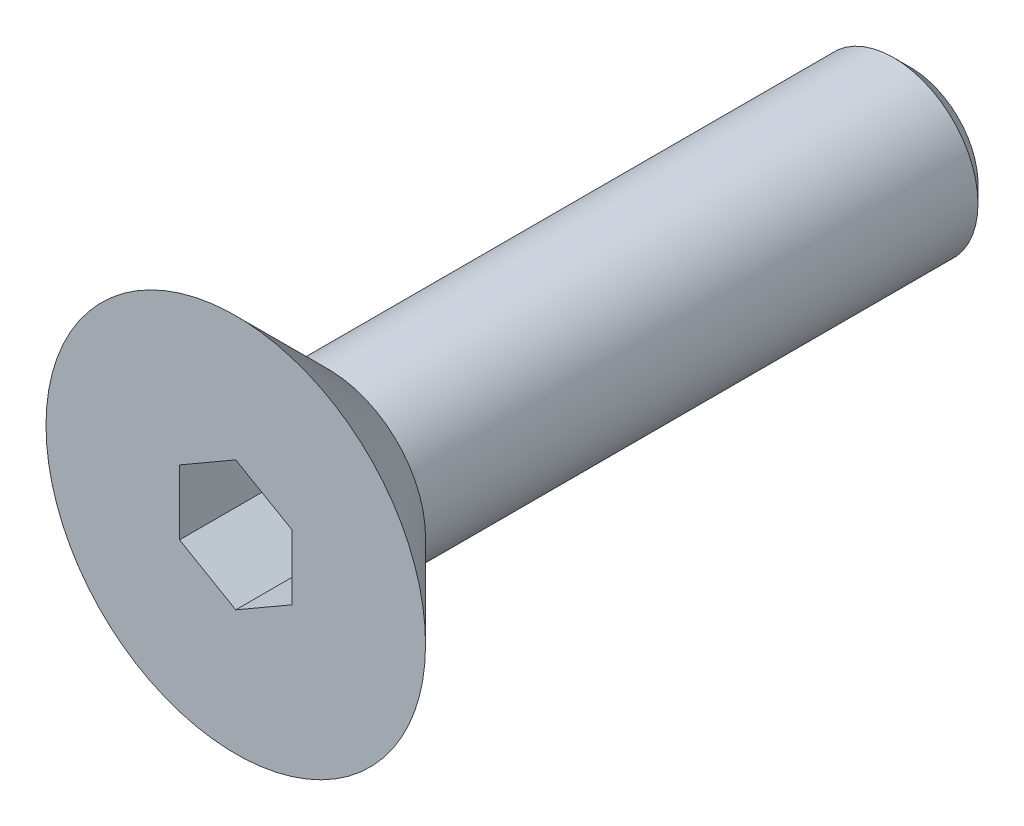
ISO-10303-21;
HEADER;
FILE_DESCRIPTION(('STEP AP214'),'2;1');
FILE_NAME('part.step','',(''),(''),'','','');
FILE_SCHEMA(('AUTOMOTIVE_DESIGN { 1 0 10303 214 1 1 1 1 }'));
ENDSEC;
DATA;
#1=APPLICATION_CONTEXT('core data for automotive mechanical design processes');
#2=APPLICATION_PROTOCOL_DEFINITION('international standard','automotive_design',2000,#1);
#3=PRODUCT_CONTEXT('',#1,'mechanical');
#4=PRODUCT('Part','Part','',(#3));
#5=PRODUCT_RELATED_PRODUCT_CATEGORY('part','',(#4));
#6=PRODUCT_DEFINITION_FORMATION('','',#4);
#7=PRODUCT_DEFINITION_CONTEXT('part definition',#1,'design');
#8=PRODUCT_DEFINITION('design','',#6,#7);
#9=PRODUCT_DEFINITION_SHAPE('','',#8);
#10=(LENGTH_UNIT() NAMED_UNIT(*) SI_UNIT(.MILLI.,.METRE.));
#11=(NAMED_UNIT(*) PLANE_ANGLE_UNIT() SI_UNIT($,.RADIAN.));
#12=(NAMED_UNIT(*) SI_UNIT($,.STERADIAN.) SOLID_ANGLE_UNIT());
#13=UNCERTAINTY_MEASURE_WITH_UNIT(LENGTH_MEASURE(1.E-05),#10,'distance_accuracy_value','');
#14=(GEOMETRIC_REPRESENTATION_CONTEXT(3) GLOBAL_UNCERTAINTY_ASSIGNED_CONTEXT((#13)) GLOBAL_UNIT_ASSIGNED_CONTEXT((#10,
#11,#12)) REPRESENTATION_CONTEXT('',''));
#15=CARTESIAN_POINT('',(0.,0.,0.));
#16=DIRECTION('',(0.,0.,1.));
#17=DIRECTION('',(1.,0.,0.));
#18=AXIS2_PLACEMENT_3D('',#15,#16,#17);
#19=CARTESIAN_POINT('',(0.,0.,0.));
#20=DIRECTION('',(0.,0.,1.));
#21=DIRECTION('',(1.,0.,0.));
#22=AXIS2_PLACEMENT_3D('',#19,#20,#21);
#23=PLANE('',#22);
#24=CARTESIAN_POINT('',(0.,0.,0.));
#25=DIRECTION('',(0.,0.,1.));
#26=DIRECTION('',(1.,0.,0.));
#27=AXIS2_PLACEMENT_3D('',#24,#25,#26);
#28=CIRCLE('',#27,1.72499999999999);
#29=CARTESIAN_POINT('',(1.72499999999999,0.,0.));
#30=VERTEX_POINT('',#29);
#31=EDGE_CURVE('E11',#30,#30,#28,.F.);
#32=ORIENTED_EDGE('',*,*,#31,.T.);
#33=EDGE_LOOP('',(#32));
#34=FACE_BOUND('',#33,.T.);
#35=CARTESIAN_POINT('',(0.,0.,0.));
#36=DIRECTION('',(0.,0.,1.));
#37=DIRECTION('',(1.,0.,0.));
#38=AXIS2_PLACEMENT_3D('',#35,#36,#37);
#39=CIRCLE('',#38,1.5);
#40=CARTESIAN_POINT('',(1.5,0.,0.));
#41=VERTEX_POINT('',#40);
#42=EDGE_CURVE('E144',#41,#41,#39,.F.);
#43=ORIENTED_EDGE('',*,*,#42,.F.);
#44=EDGE_LOOP('',(#43));
#45=FACE_BOUND('',#44,.T.);
#46=ADVANCED_FACE('F34',(#34,#45),#23,.F.);
#47=CARTESIAN_POINT('',(0.,0.,1.65));
#48=DIRECTION('',(0.,0.,1.));
#49=DIRECTION('',(1.,0.,0.));
#50=AXIS2_PLACEMENT_3D('',#47,#48,#49);
#51=PLANE('',#50);
#52=DIRECTION('',(-0.866025403784439,0.5,0.));
#53=VECTOR('',#52,1.);
#54=CARTESIAN_POINT('',(1.,0.577350269189626,1.65));
#55=LINE('',#54,#53);
#56=CARTESIAN_POINT('',(1.,0.577350269189626,1.65));
#57=VERTEX_POINT('',#56);
#58=CARTESIAN_POINT('',(0.,1.15470053837925,1.65));
#59=VERTEX_POINT('',#58);
#60=EDGE_CURVE('E49',#57,#59,#55,.T.);
#61=ORIENTED_EDGE('',*,*,#60,.F.);
#62=DIRECTION('',(0.,1.,0.));
#63=VECTOR('',#62,1.);
#64=CARTESIAN_POINT('',(1.,-0.577350269189626,1.65));
#65=LINE('',#64,#63);
#66=CARTESIAN_POINT('',(1.,-0.577350269189626,1.65));
#67=VERTEX_POINT('',#66);
#68=EDGE_CURVE('E132',#67,#57,#65,.T.);
#69=ORIENTED_EDGE('',*,*,#68,.F.);
#70=DIRECTION('',(0.866025403784439,0.5,0.));
#71=VECTOR('',#70,1.);
#72=CARTESIAN_POINT('',(0.,-1.15470053837925,1.65));
#73=LINE('',#72,#71);
#74=CARTESIAN_POINT('',(0.,-1.15470053837925,1.65));
#75=VERTEX_POINT('',#74);
#76=EDGE_CURVE('E130',#75,#67,#73,.T.);
#77=ORIENTED_EDGE('',*,*,#76,.F.);
#78=DIRECTION('',(0.866025403784439,-0.5,0.));
#79=VECTOR('',#78,1.);
#80=CARTESIAN_POINT('',(-1.,-0.577350269189626,1.65));
#81=LINE('',#80,#79);
#82=CARTESIAN_POINT('',(-1.,-0.577350269189626,1.65));
#83=VERTEX_POINT('',#82);
#84=EDGE_CURVE('E97',#83,#75,#81,.T.);
#85=ORIENTED_EDGE('',*,*,#84,.F.);
#86=DIRECTION('',(0.,-1.,0.));
#87=VECTOR('',#86,1.);
#88=CARTESIAN_POINT('',(-1.,0.577350269189626,1.65));
#89=LINE('',#88,#87);
#90=CARTESIAN_POINT('',(-1.,0.577350269189626,1.65));
#91=VERTEX_POINT('',#90);
#92=EDGE_CURVE('E126',#91,#83,#89,.T.);
#93=ORIENTED_EDGE('',*,*,#92,.F.);
#94=DIRECTION('',(-0.866025403784439,-0.5,0.));
#95=VECTOR('',#94,1.);
#96=CARTESIAN_POINT('',(0.,1.15470053837925,1.65));
#97=LINE('',#96,#95);
#98=EDGE_CURVE('E123',#59,#91,#97,.T.);
#99=ORIENTED_EDGE('',*,*,#98,.F.);
#100=EDGE_LOOP('',(#61,#69,#77,#85,#93,#99));
#101=FACE_BOUND('',#100,.T.);
#102=CARTESIAN_POINT('',(0.,0.,1.65));
#103=DIRECTION('',(0.,0.,1.));
#104=DIRECTION('',(1.,0.,0.));
#105=AXIS2_PLACEMENT_3D('',#102,#103,#104);
#106=CIRCLE('',#105,3.375);
#107=CARTESIAN_POINT('',(3.375,0.,1.65));
#108=VERTEX_POINT('',#107);
#109=EDGE_CURVE('E136',#108,#108,#106,.T.);
#110=ORIENTED_EDGE('',*,*,#109,.T.);
#111=EDGE_LOOP('',(#110));
#112=FACE_BOUND('',#111,.T.);
#113=ADVANCED_FACE('F167',(#101,#112),#51,.T.);
#114=CARTESIAN_POINT('',(0.,0.,-10.35));
#115=DIRECTION('',(0.,0.,1.));
#116=DIRECTION('',(1.,0.,0.));
#117=AXIS2_PLACEMENT_3D('',#114,#115,#116);
#118=CYLINDRICAL_SURFACE('',#117,1.5);
#119=CARTESIAN_POINT('',(0.,0.,-10.05));
#120=DIRECTION('',(0.,0.,-1.));
#121=DIRECTION('',(-1.,0.,0.));
#122=AXIS2_PLACEMENT_3D('',#119,#120,#121);
#123=CIRCLE('',#122,1.5);
#124=CARTESIAN_POINT('',(-1.5,0.,-10.05));
#125=VERTEX_POINT('',#124);
#126=EDGE_CURVE('E42',#125,#125,#123,.F.);
#127=ORIENTED_EDGE('',*,*,#126,.T.);
#128=EDGE_LOOP('',(#127));
#129=FACE_BOUND('',#128,.T.);
#130=ORIENTED_EDGE('',*,*,#42,.T.);
#131=EDGE_LOOP('',(#130));
#132=FACE_BOUND('',#131,.T.);
#133=ADVANCED_FACE('F152',(#129,#132),#118,.T.);
#134=CARTESIAN_POINT('',(0.,0.,-10.35));
#135=DIRECTION('',(0.,0.,-1.));
#136=DIRECTION('',(-1.,0.,0.));
#137=AXIS2_PLACEMENT_3D('',#134,#135,#136);
#138=PLANE('',#137);
#139=CARTESIAN_POINT('',(0.,0.,-10.35));
#140=DIRECTION('',(0.,0.,-1.));
#141=DIRECTION('',(-1.,0.,0.));
#142=AXIS2_PLACEMENT_3D('',#139,#140,#141);
#143=CIRCLE('',#142,1.2);
#144=CARTESIAN_POINT('',(-1.2,0.,-10.35));
#145=VERTEX_POINT('',#144);
#146=EDGE_CURVE('E147',#145,#145,#143,.T.);
#147=ORIENTED_EDGE('',*,*,#146,.T.);
#148=EDGE_LOOP('',(#147));
#149=FACE_BOUND('',#148,.T.);
#150=ADVANCED_FACE('F159',(#149),#138,.T.);
#151=CARTESIAN_POINT('',(0.,0.,-10.35));
#152=DIRECTION('',(0.,0.,1.));
#153=DIRECTION('',(1.,0.,0.));
#154=AXIS2_PLACEMENT_3D('',#151,#152,#153);
#155=CONICAL_SURFACE('',#154,1.2,0.785398163397447);
#156=ORIENTED_EDGE('',*,*,#126,.F.);
#157=EDGE_LOOP('',(#156));
#158=FACE_BOUND('',#157,.T.);
#159=ORIENTED_EDGE('',*,*,#146,.F.);
#160=EDGE_LOOP('',(#159));
#161=FACE_BOUND('',#160,.T.);
#162=ADVANCED_FACE('F155',(#158,#161),#155,.T.);
#163=CARTESIAN_POINT('',(1.,0.577350269189626,-0.35));
#164=DIRECTION('',(0.5,0.866025403784439,0.));
#165=DIRECTION('',(-0.866025403784439,0.5,0.));
#166=AXIS2_PLACEMENT_3D('',#163,#164,#165);
#167=PLANE('',#166);
#168=ORIENTED_EDGE('',*,*,#60,.T.);
#169=DIRECTION('',(0.,0.,1.));
#170=VECTOR('',#169,1.);
#171=CARTESIAN_POINT('',(0.,1.15470053837925,-0.35));
#172=LINE('',#171,#170);
#173=CARTESIAN_POINT('',(0.,1.15470053837925,-0.35));
#174=VERTEX_POINT('',#173);
#175=EDGE_CURVE('E79',#174,#59,#172,.T.);
#176=ORIENTED_EDGE('',*,*,#175,.F.);
#177=DIRECTION('',(-0.866025403784439,0.5,0.));
#178=VECTOR('',#177,1.);
#179=CARTESIAN_POINT('',(1.,0.577350269189626,-0.35));
#180=LINE('',#179,#178);
#181=CARTESIAN_POINT('',(1.,0.577350269189626,-0.35));
#182=VERTEX_POINT('',#181);
#183=EDGE_CURVE('E134',#182,#174,#180,.T.);
#184=ORIENTED_EDGE('',*,*,#183,.F.);
#185=DIRECTION('',(0.,0.,1.));
#186=VECTOR('',#185,1.);
#187=CARTESIAN_POINT('',(1.,0.577350269189626,-0.35));
#188=LINE('',#187,#186);
#189=EDGE_CURVE('E57',#182,#57,#188,.T.);
#190=ORIENTED_EDGE('',*,*,#189,.T.);
#191=EDGE_LOOP('',(#168,#176,#184,#190));
#192=FACE_BOUND('',#191,.T.);
#193=ADVANCED_FACE('F158',(#192),#167,.F.);
#194=CARTESIAN_POINT('',(1.,-0.577350269189626,-0.35));
#195=DIRECTION('',(1.,0.,0.));
#196=DIRECTION('',(0.,1.,0.));
#197=AXIS2_PLACEMENT_3D('',#194,#195,#196);
#198=PLANE('',#197);
#199=ORIENTED_EDGE('',*,*,#68,.T.);
#200=ORIENTED_EDGE('',*,*,#189,.F.);
#201=DIRECTION('',(0.,1.,0.));
#202=VECTOR('',#201,1.);
#203=CARTESIAN_POINT('',(1.,-0.577350269189626,-0.35));
#204=LINE('',#203,#202);
#205=CARTESIAN_POINT('',(1.,-0.577350269189626,-0.35));
#206=VERTEX_POINT('',#205);
#207=EDGE_CURVE('E109',#206,#182,#204,.T.);
#208=ORIENTED_EDGE('',*,*,#207,.F.);
#209=DIRECTION('',(0.,0.,1.));
#210=VECTOR('',#209,1.);
#211=CARTESIAN_POINT('',(1.,-0.577350269189626,-0.35));
#212=LINE('',#211,#210);
#213=EDGE_CURVE('E101',#206,#67,#212,.T.);
#214=ORIENTED_EDGE('',*,*,#213,.T.);
#215=EDGE_LOOP('',(#199,#200,#208,#214));
#216=FACE_BOUND('',#215,.T.);
#217=ADVANCED_FACE('F198',(#216),#198,.F.);
#218=CARTESIAN_POINT('',(0.,-1.15470053837925,-0.35));
#219=DIRECTION('',(0.5,-0.866025403784439,0.));
#220=DIRECTION('',(0.866025403784439,0.5,0.));
#221=AXIS2_PLACEMENT_3D('',#218,#219,#220);
#222=PLANE('',#221);
#223=ORIENTED_EDGE('',*,*,#76,.T.);
#224=ORIENTED_EDGE('',*,*,#213,.F.);
#225=DIRECTION('',(0.866025403784439,0.5,0.));
#226=VECTOR('',#225,1.);
#227=CARTESIAN_POINT('',(0.,-1.15470053837925,-0.35));
#228=LINE('',#227,#226);
#229=CARTESIAN_POINT('',(0.,-1.15470053837925,-0.35));
#230=VERTEX_POINT('',#229);
#231=EDGE_CURVE('E105',#230,#206,#228,.T.);
#232=ORIENTED_EDGE('',*,*,#231,.F.);
#233=DIRECTION('',(0.,0.,1.));
#234=VECTOR('',#233,1.);
#235=CARTESIAN_POINT('',(0.,-1.15470053837925,-0.35));
#236=LINE('',#235,#234);
#237=EDGE_CURVE('E90',#230,#75,#236,.T.);
#238=ORIENTED_EDGE('',*,*,#237,.T.);
#239=EDGE_LOOP('',(#223,#224,#232,#238));
#240=FACE_BOUND('',#239,.T.);
#241=ADVANCED_FACE('F106',(#240),#222,.F.);
#242=CARTESIAN_POINT('',(-1.,-0.577350269189626,-0.35));
#243=DIRECTION('',(-0.5,-0.866025403784439,0.));
#244=DIRECTION('',(0.866025403784439,-0.5,0.));
#245=AXIS2_PLACEMENT_3D('',#242,#243,#244);
#246=PLANE('',#245);
#247=ORIENTED_EDGE('',*,*,#84,.T.);
#248=ORIENTED_EDGE('',*,*,#237,.F.);
#249=DIRECTION('',(0.866025403784439,-0.5,0.));
#250=VECTOR('',#249,1.);
#251=CARTESIAN_POINT('',(-1.,-0.577350269189626,-0.35));
#252=LINE('',#251,#250);
#253=CARTESIAN_POINT('',(-1.,-0.577350269189626,-0.35));
#254=VERTEX_POINT('',#253);
#255=EDGE_CURVE('E94',#254,#230,#252,.T.);
#256=ORIENTED_EDGE('',*,*,#255,.F.);
#257=DIRECTION('',(0.,0.,1.));
#258=VECTOR('',#257,1.);
#259=CARTESIAN_POINT('',(-1.,-0.577350269189626,-0.35));
#260=LINE('',#259,#258);
#261=EDGE_CURVE('E102',#254,#83,#260,.T.);
#262=ORIENTED_EDGE('',*,*,#261,.T.);
#263=EDGE_LOOP('',(#247,#248,#256,#262));
#264=FACE_BOUND('',#263,.T.);
#265=ADVANCED_FACE('F92',(#264),#246,.F.);
#266=CARTESIAN_POINT('',(-1.,0.577350269189626,-0.35));
#267=DIRECTION('',(-1.,0.,0.));
#268=DIRECTION('',(0.,-1.,0.));
#269=AXIS2_PLACEMENT_3D('',#266,#267,#268);
#270=PLANE('',#269);
#271=ORIENTED_EDGE('',*,*,#92,.T.);
#272=ORIENTED_EDGE('',*,*,#261,.F.);
#273=DIRECTION('',(0.,-1.,0.));
#274=VECTOR('',#273,1.);
#275=CARTESIAN_POINT('',(-1.,0.577350269189626,-0.35));
#276=LINE('',#275,#274);
#277=CARTESIAN_POINT('',(-1.,0.577350269189626,-0.35));
#278=VERTEX_POINT('',#277);
#279=EDGE_CURVE('E115',#278,#254,#276,.T.);
#280=ORIENTED_EDGE('',*,*,#279,.F.);
#281=DIRECTION('',(0.,0.,1.));
#282=VECTOR('',#281,1.);
#283=CARTESIAN_POINT('',(-1.,0.577350269189626,-0.35));
#284=LINE('',#283,#282);
#285=EDGE_CURVE('E139',#278,#91,#284,.T.);
#286=ORIENTED_EDGE('',*,*,#285,.T.);
#287=EDGE_LOOP('',(#271,#272,#280,#286));
#288=FACE_BOUND('',#287,.T.);
#289=ADVANCED_FACE('F194',(#288),#270,.F.);
#290=CARTESIAN_POINT('',(0.,1.15470053837925,-0.35));
#291=DIRECTION('',(-0.5,0.866025403784439,0.));
#292=DIRECTION('',(-0.866025403784439,-0.5,0.));
#293=AXIS2_PLACEMENT_3D('',#290,#291,#292);
#294=PLANE('',#293);
#295=ORIENTED_EDGE('',*,*,#98,.T.);
#296=ORIENTED_EDGE('',*,*,#285,.F.);
#297=DIRECTION('',(-0.866025403784439,-0.5,0.));
#298=VECTOR('',#297,1.);
#299=CARTESIAN_POINT('',(0.,1.15470053837925,-0.35));
#300=LINE('',#299,#298);
#301=EDGE_CURVE('E117',#174,#278,#300,.T.);
#302=ORIENTED_EDGE('',*,*,#301,.F.);
#303=ORIENTED_EDGE('',*,*,#175,.T.);
#304=EDGE_LOOP('',(#295,#296,#302,#303));
#305=FACE_BOUND('',#304,.T.);
#306=ADVANCED_FACE('F189',(#305),#294,.F.);
#307=CARTESIAN_POINT('',(0.,0.,-0.35));
#308=DIRECTION('',(0.,0.,1.));
#309=DIRECTION('',(1.,0.,0.));
#310=AXIS2_PLACEMENT_3D('',#307,#308,#309);
#311=PLANE('',#310);
#312=ORIENTED_EDGE('',*,*,#183,.T.);
#313=ORIENTED_EDGE('',*,*,#301,.T.);
#314=ORIENTED_EDGE('',*,*,#279,.T.);
#315=ORIENTED_EDGE('',*,*,#255,.T.);
#316=ORIENTED_EDGE('',*,*,#231,.T.);
#317=ORIENTED_EDGE('',*,*,#207,.T.);
#318=EDGE_LOOP('',(#312,#313,#314,#315,#316,#317));
#319=FACE_BOUND('',#318,.T.);
#320=ADVANCED_FACE('F112',(#319),#311,.T.);
#321=CARTESIAN_POINT('',(0.,0.,1.65));
#322=DIRECTION('',(0.,0.,1.));
#323=DIRECTION('',(1.,0.,0.));
#324=AXIS2_PLACEMENT_3D('',#321,#322,#323);
#325=CONICAL_SURFACE('',#324,3.375,0.78539816339745);
#326=ORIENTED_EDGE('',*,*,#31,.F.);
#327=EDGE_LOOP('',(#326));
#328=FACE_BOUND('',#327,.T.);
#329=ORIENTED_EDGE('',*,*,#109,.F.);
#330=EDGE_LOOP('',(#329));
#331=FACE_BOUND('',#330,.T.);
#332=ADVANCED_FACE('F36',(#328,#331),#325,.T.);
#333=CLOSED_SHELL('',(#46,#113,#133,#150,#162,#193,#217,#241,#265,#289,#306,#320,#332));
#334=MANIFOLD_SOLID_BREP('B2',#333);
#335=ADVANCED_BREP_SHAPE_REPRESENTATION('',(#18,#334),#14);
#336=SHAPE_DEFINITION_REPRESENTATION(#9,#335);
ENDSEC;
END-ISO-10303-21;
